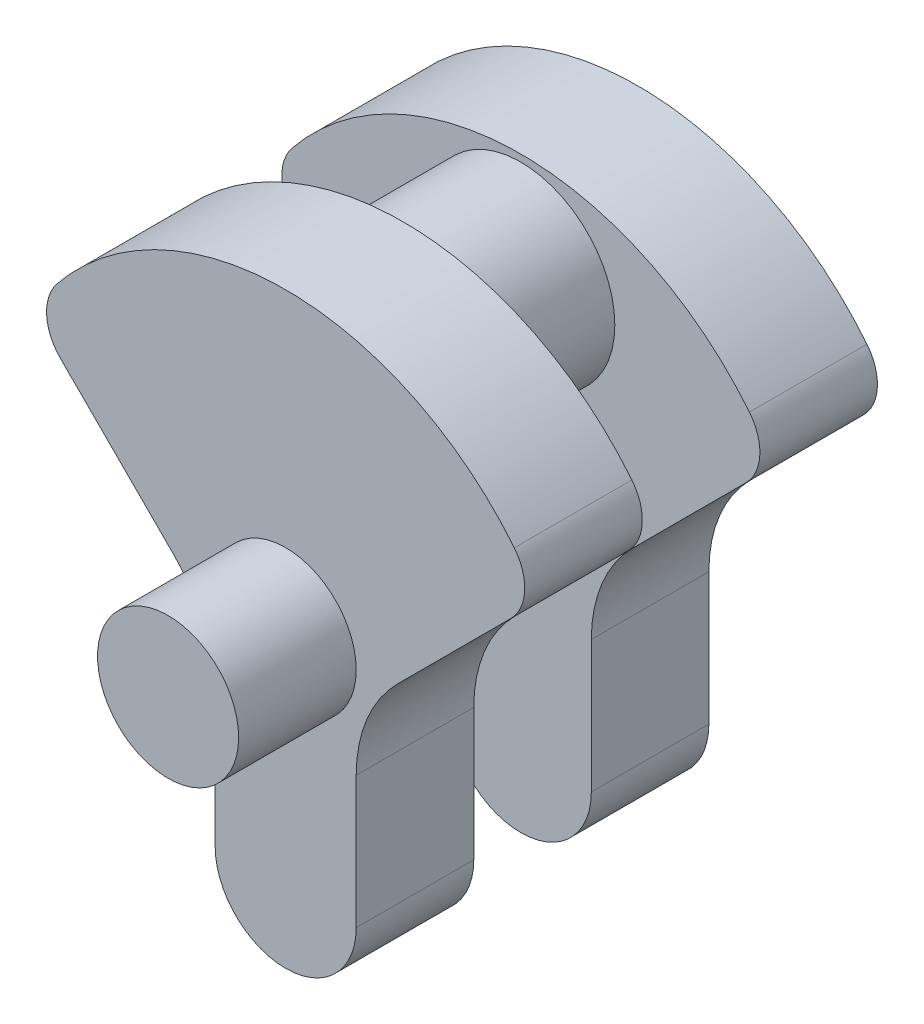
ISO-10303-21;
HEADER;
FILE_DESCRIPTION(('STEP AP214'),'2;1');
FILE_NAME('part.step','',(''),(''),'','','');
FILE_SCHEMA(('AUTOMOTIVE_DESIGN { 1 0 10303 214 1 1 1 1 }'));
ENDSEC;
DATA;
#1=APPLICATION_CONTEXT('core data for automotive mechanical design processes');
#2=APPLICATION_PROTOCOL_DEFINITION('international standard','automotive_design',2000,#1);
#3=PRODUCT_CONTEXT('',#1,'mechanical');
#4=PRODUCT('Part','Part','',(#3));
#5=PRODUCT_RELATED_PRODUCT_CATEGORY('part','',(#4));
#6=PRODUCT_DEFINITION_FORMATION('','',#4);
#7=PRODUCT_DEFINITION_CONTEXT('part definition',#1,'design');
#8=PRODUCT_DEFINITION('design','',#6,#7);
#9=PRODUCT_DEFINITION_SHAPE('','',#8);
#10=(LENGTH_UNIT() NAMED_UNIT(*) SI_UNIT(.MILLI.,.METRE.));
#11=(NAMED_UNIT(*) PLANE_ANGLE_UNIT() SI_UNIT($,.RADIAN.));
#12=(NAMED_UNIT(*) SI_UNIT($,.STERADIAN.) SOLID_ANGLE_UNIT());
#13=UNCERTAINTY_MEASURE_WITH_UNIT(LENGTH_MEASURE(1.E-05),#10,'distance_accuracy_value','');
#14=(GEOMETRIC_REPRESENTATION_CONTEXT(3) GLOBAL_UNCERTAINTY_ASSIGNED_CONTEXT((#13)) GLOBAL_UNIT_ASSIGNED_CONTEXT((#10,
#11,#12)) REPRESENTATION_CONTEXT('',''));
#15=CARTESIAN_POINT('',(0.,0.,0.));
#16=DIRECTION('',(0.,0.,1.));
#17=DIRECTION('',(1.,0.,0.));
#18=AXIS2_PLACEMENT_3D('',#15,#16,#17);
#19=CARTESIAN_POINT('',(11.,-11.,37.5));
#20=DIRECTION('',(-0.707106781186549,0.707106781186546,0.));
#21=DIRECTION('',(-0.707106781186546,-0.707106781186549,0.));
#22=AXIS2_PLACEMENT_3D('',#19,#20,#21);
#23=PLANE('',#22);
#24=DIRECTION('',(0.707106781186546,0.707106781186549,0.));
#25=VECTOR('',#24,1.);
#26=CARTESIAN_POINT('',(11.,-11.,37.5));
#27=LINE('',#26,#25);
#28=CARTESIAN_POINT('',(23.7867965644035,1.78679656440356,37.5));
#29=VERTEX_POINT('',#28);
#30=CARTESIAN_POINT('',(47.9146108182253,25.9146108182255,37.5));
#31=VERTEX_POINT('',#30);
#32=EDGE_CURVE('E269',#29,#31,#27,.T.);
#33=ORIENTED_EDGE('',*,*,#32,.F.);
#34=DIRECTION('',(0.,0.,-1.));
#35=VECTOR('',#34,1.);
#36=CARTESIAN_POINT('',(23.7867965644035,1.78679656440356,37.5));
#37=LINE('',#36,#35);
#38=CARTESIAN_POINT('',(23.7867965644035,1.78679656440356,12.5));
#39=VERTEX_POINT('',#38);
#40=EDGE_CURVE('E211',#29,#39,#37,.T.);
#41=ORIENTED_EDGE('',*,*,#40,.T.);
#42=DIRECTION('',(0.707106781186546,0.707106781186549,0.));
#43=VECTOR('',#42,1.);
#44=CARTESIAN_POINT('',(11.,-11.,12.5));
#45=LINE('',#44,#43);
#46=CARTESIAN_POINT('',(47.9146108182253,25.9146108182255,12.5));
#47=VERTEX_POINT('',#46);
#48=EDGE_CURVE('E326',#39,#47,#45,.T.);
#49=ORIENTED_EDGE('',*,*,#48,.T.);
#50=DIRECTION('',(0.,0.,-1.));
#51=VECTOR('',#50,1.);
#52=CARTESIAN_POINT('',(47.9146108182253,25.9146108182255,37.5));
#53=LINE('',#52,#51);
#54=EDGE_CURVE('E288',#47,#31,#53,.F.);
#55=ORIENTED_EDGE('',*,*,#54,.T.);
#56=EDGE_LOOP('',(#33,#41,#49,#55));
#57=FACE_BOUND('',#56,.T.);
#58=ADVANCED_FACE('F35',(#57),#23,.F.);
#59=CARTESIAN_POINT('',(0.,0.,37.5));
#60=DIRECTION('',(0.,0.,-1.));
#61=DIRECTION('',(-1.,0.,0.));
#62=AXIS2_PLACEMENT_3D('',#59,#60,#61);
#63=CYLINDRICAL_SURFACE('',#62,62.5);
#64=DIRECTION('',(0.,0.,-1.));
#65=VECTOR('',#64,1.);
#66=CARTESIAN_POINT('',(48.6232654837617,39.2686650358225,37.5));
#67=LINE('',#66,#65);
#68=CARTESIAN_POINT('',(48.6232654837617,39.2686650358225,37.5));
#69=VERTEX_POINT('',#68);
#70=CARTESIAN_POINT('',(48.6232654837617,39.2686650358225,12.5));
#71=VERTEX_POINT('',#70);
#72=EDGE_CURVE('E281',#69,#71,#67,.T.);
#73=ORIENTED_EDGE('',*,*,#72,.T.);
#74=CARTESIAN_POINT('',(0.,0.,12.5));
#75=DIRECTION('',(0.,0.,1.));
#76=DIRECTION('',(1.,0.,0.));
#77=AXIS2_PLACEMENT_3D('',#74,#75,#76);
#78=CIRCLE('',#77,62.5);
#79=CARTESIAN_POINT('',(-48.6232654837617,39.2686650358225,12.5));
#80=VERTEX_POINT('',#79);
#81=EDGE_CURVE('E311',#71,#80,#78,.T.);
#82=ORIENTED_EDGE('',*,*,#81,.T.);
#83=DIRECTION('',(0.,0.,-1.));
#84=VECTOR('',#83,1.);
#85=CARTESIAN_POINT('',(-48.6232654837617,39.2686650358225,37.5));
#86=LINE('',#85,#84);
#87=CARTESIAN_POINT('',(-48.6232654837617,39.2686650358225,37.5));
#88=VERTEX_POINT('',#87);
#89=EDGE_CURVE('E277',#80,#88,#86,.F.);
#90=ORIENTED_EDGE('',*,*,#89,.T.);
#91=CARTESIAN_POINT('',(0.,0.,37.5));
#92=DIRECTION('',(0.,0.,1.));
#93=DIRECTION('',(1.,0.,0.));
#94=AXIS2_PLACEMENT_3D('',#91,#92,#93);
#95=CIRCLE('',#94,62.5);
#96=EDGE_CURVE('E299',#69,#88,#95,.T.);
#97=ORIENTED_EDGE('',*,*,#96,.F.);
#98=EDGE_LOOP('',(#73,#82,#90,#97));
#99=FACE_BOUND('',#98,.T.);
#100=ADVANCED_FACE('F315',(#99),#63,.T.);
#101=CARTESIAN_POINT('',(-11.,-11.,37.5));
#102=DIRECTION('',(0.707106781186549,0.707106781186546,0.));
#103=DIRECTION('',(-0.707106781186546,0.707106781186549,0.));
#104=AXIS2_PLACEMENT_3D('',#101,#102,#103);
#105=PLANE('',#104);
#106=DIRECTION('',(0.707106781186546,-0.707106781186549,0.));
#107=VECTOR('',#106,1.);
#108=CARTESIAN_POINT('',(-11.,-11.,12.5));
#109=LINE('',#108,#107);
#110=CARTESIAN_POINT('',(-47.9146108182253,25.9146108182254,12.5));
#111=VERTEX_POINT('',#110);
#112=CARTESIAN_POINT('',(-23.7867965644035,1.78679656440357,12.5));
#113=VERTEX_POINT('',#112);
#114=EDGE_CURVE('E313',#111,#113,#109,.T.);
#115=ORIENTED_EDGE('',*,*,#114,.T.);
#116=DIRECTION('',(0.,0.,-1.));
#117=VECTOR('',#116,1.);
#118=CARTESIAN_POINT('',(-23.7867965644035,1.78679656440357,37.5));
#119=LINE('',#118,#117);
#120=CARTESIAN_POINT('',(-23.7867965644035,1.78679656440357,37.5));
#121=VERTEX_POINT('',#120);
#122=EDGE_CURVE('E50',#113,#121,#119,.F.);
#123=ORIENTED_EDGE('',*,*,#122,.T.);
#124=DIRECTION('',(0.707106781186546,-0.707106781186549,0.));
#125=VECTOR('',#124,1.);
#126=CARTESIAN_POINT('',(-11.,-11.,37.5));
#127=LINE('',#126,#125);
#128=CARTESIAN_POINT('',(-47.9146108182253,25.9146108182254,37.5));
#129=VERTEX_POINT('',#128);
#130=EDGE_CURVE('E296',#129,#121,#127,.T.);
#131=ORIENTED_EDGE('',*,*,#130,.F.);
#132=DIRECTION('',(0.,0.,-1.));
#133=VECTOR('',#132,1.);
#134=CARTESIAN_POINT('',(-47.9146108182253,25.9146108182254,37.5));
#135=LINE('',#134,#133);
#136=EDGE_CURVE('E184',#129,#111,#135,.T.);
#137=ORIENTED_EDGE('',*,*,#136,.T.);
#138=EDGE_LOOP('',(#115,#123,#131,#137));
#139=FACE_BOUND('',#138,.T.);
#140=ADVANCED_FACE('F303',(#139),#105,.F.);
#141=CARTESIAN_POINT('',(-15.,0.,37.5));
#142=DIRECTION('',(1.,0.,0.));
#143=DIRECTION('',(0.,1.,0.));
#144=AXIS2_PLACEMENT_3D('',#141,#142,#143);
#145=PLANE('',#144);
#146=DIRECTION('',(0.,-1.,0.));
#147=VECTOR('',#146,1.);
#148=CARTESIAN_POINT('',(-15.,0.,37.5));
#149=LINE('',#148,#147);
#150=CARTESIAN_POINT('',(-15.,-19.4264068711928,37.5));
#151=VERTEX_POINT('',#150);
#152=CARTESIAN_POINT('',(-15.,-47.5,37.5));
#153=VERTEX_POINT('',#152);
#154=EDGE_CURVE('E304',#151,#153,#149,.T.);
#155=ORIENTED_EDGE('',*,*,#154,.F.);
#156=DIRECTION('',(0.,0.,-1.));
#157=VECTOR('',#156,1.);
#158=CARTESIAN_POINT('',(-15.,-19.4264068711928,12.5));
#159=LINE('',#158,#157);
#160=CARTESIAN_POINT('',(-15.,-19.4264068711928,12.5));
#161=VERTEX_POINT('',#160);
#162=EDGE_CURVE('E220',#151,#161,#159,.T.);
#163=ORIENTED_EDGE('',*,*,#162,.T.);
#164=DIRECTION('',(0.,-1.,0.));
#165=VECTOR('',#164,1.);
#166=CARTESIAN_POINT('',(-15.,0.,12.5));
#167=LINE('',#166,#165);
#168=CARTESIAN_POINT('',(-15.,-47.5,12.5));
#169=VERTEX_POINT('',#168);
#170=EDGE_CURVE('E319',#161,#169,#167,.T.);
#171=ORIENTED_EDGE('',*,*,#170,.T.);
#172=DIRECTION('',(0.,0.,-1.));
#173=VECTOR('',#172,1.);
#174=CARTESIAN_POINT('',(-15.,-47.5,37.5));
#175=LINE('',#174,#173);
#176=EDGE_CURVE('E274',#153,#169,#175,.T.);
#177=ORIENTED_EDGE('',*,*,#176,.F.);
#178=EDGE_LOOP('',(#155,#163,#171,#177));
#179=FACE_BOUND('',#178,.T.);
#180=ADVANCED_FACE('F404',(#179),#145,.F.);
#181=CARTESIAN_POINT('',(0.,-47.5,37.5));
#182=DIRECTION('',(0.,0.,-1.));
#183=DIRECTION('',(-1.,0.,0.));
#184=AXIS2_PLACEMENT_3D('',#181,#182,#183);
#185=CYLINDRICAL_SURFACE('',#184,15.);
#186=ORIENTED_EDGE('',*,*,#176,.T.);
#187=CARTESIAN_POINT('',(0.,-47.5,12.5));
#188=DIRECTION('',(0.,0.,1.));
#189=DIRECTION('',(1.,0.,0.));
#190=AXIS2_PLACEMENT_3D('',#187,#188,#189);
#191=CIRCLE('',#190,15.);
#192=CARTESIAN_POINT('',(15.,-47.5,12.5));
#193=VERTEX_POINT('',#192);
#194=EDGE_CURVE('E330',#169,#193,#191,.T.);
#195=ORIENTED_EDGE('',*,*,#194,.T.);
#196=DIRECTION('',(0.,0.,-1.));
#197=VECTOR('',#196,1.);
#198=CARTESIAN_POINT('',(15.,-47.5,37.5));
#199=LINE('',#198,#197);
#200=CARTESIAN_POINT('',(15.,-47.5,37.5));
#201=VERTEX_POINT('',#200);
#202=EDGE_CURVE('E270',#201,#193,#199,.T.);
#203=ORIENTED_EDGE('',*,*,#202,.F.);
#204=CARTESIAN_POINT('',(0.,-47.5,37.5));
#205=DIRECTION('',(0.,0.,1.));
#206=DIRECTION('',(1.,0.,0.));
#207=AXIS2_PLACEMENT_3D('',#204,#205,#206);
#208=CIRCLE('',#207,15.);
#209=EDGE_CURVE('E336',#153,#201,#208,.T.);
#210=ORIENTED_EDGE('',*,*,#209,.F.);
#211=EDGE_LOOP('',(#186,#195,#203,#210));
#212=FACE_BOUND('',#211,.T.);
#213=ADVANCED_FACE('F409',(#212),#185,.T.);
#214=CARTESIAN_POINT('',(15.,0.,37.5));
#215=DIRECTION('',(1.,0.,0.));
#216=DIRECTION('',(0.,1.,0.));
#217=AXIS2_PLACEMENT_3D('',#214,#215,#216);
#218=PLANE('',#217);
#219=DIRECTION('',(0.,-1.,0.));
#220=VECTOR('',#219,1.);
#221=CARTESIAN_POINT('',(15.,0.,12.5));
#222=LINE('',#221,#220);
#223=CARTESIAN_POINT('',(15.,-19.4264068711928,12.5));
#224=VERTEX_POINT('',#223);
#225=EDGE_CURVE('E328',#224,#193,#222,.T.);
#226=ORIENTED_EDGE('',*,*,#225,.F.);
#227=DIRECTION('',(0.,0.,-1.));
#228=VECTOR('',#227,1.);
#229=CARTESIAN_POINT('',(15.,-19.4264068711928,37.5));
#230=LINE('',#229,#228);
#231=CARTESIAN_POINT('',(15.,-19.4264068711928,37.5));
#232=VERTEX_POINT('',#231);
#233=EDGE_CURVE('E214',#224,#232,#230,.F.);
#234=ORIENTED_EDGE('',*,*,#233,.T.);
#235=DIRECTION('',(0.,-1.,0.));
#236=VECTOR('',#235,1.);
#237=CARTESIAN_POINT('',(15.,0.,37.5));
#238=LINE('',#237,#236);
#239=EDGE_CURVE('E339',#232,#201,#238,.T.);
#240=ORIENTED_EDGE('',*,*,#239,.T.);
#241=ORIENTED_EDGE('',*,*,#202,.T.);
#242=EDGE_LOOP('',(#226,#234,#240,#241));
#243=FACE_BOUND('',#242,.T.);
#244=ADVANCED_FACE('F416',(#243),#218,.T.);
#245=CARTESIAN_POINT('',(0.,0.,37.5));
#246=DIRECTION('',(0.,0.,1.));
#247=DIRECTION('',(1.,0.,0.));
#248=AXIS2_PLACEMENT_3D('',#245,#246,#247);
#249=PLANE('',#248);
#250=CARTESIAN_POINT('',(0.,0.,37.5));
#251=DIRECTION('',(0.,0.,1.));
#252=DIRECTION('',(1.,0.,0.));
#253=AXIS2_PLACEMENT_3D('',#250,#251,#252);
#254=CIRCLE('',#253,15.);
#255=CARTESIAN_POINT('',(15.,0.,37.5));
#256=VERTEX_POINT('',#255);
#257=EDGE_CURVE('E622',#256,#256,#254,.T.);
#258=ORIENTED_EDGE('',*,*,#257,.F.);
#259=EDGE_LOOP('',(#258));
#260=FACE_BOUND('',#259,.T.);
#261=ORIENTED_EDGE('',*,*,#239,.F.);
#262=CARTESIAN_POINT('',(45.,-19.4264068711928,37.5));
#263=DIRECTION('',(0.,0.,1.));
#264=DIRECTION('',(1.,0.,0.));
#265=AXIS2_PLACEMENT_3D('',#262,#263,#264);
#266=CIRCLE('',#265,30.);
#267=EDGE_CURVE('E230',#232,#29,#266,.F.);
#268=ORIENTED_EDGE('',*,*,#267,.T.);
#269=ORIENTED_EDGE('',*,*,#32,.T.);
#270=CARTESIAN_POINT('',(40.8435430063598,32.9856786300909,37.5));
#271=DIRECTION('',(0.,0.,1.));
#272=DIRECTION('',(1.,0.,0.));
#273=AXIS2_PLACEMENT_3D('',#270,#271,#272);
#274=CIRCLE('',#273,10.);
#275=EDGE_CURVE('E198',#31,#69,#274,.T.);
#276=ORIENTED_EDGE('',*,*,#275,.T.);
#277=ORIENTED_EDGE('',*,*,#96,.T.);
#278=CARTESIAN_POINT('',(-40.8435430063598,32.9856786300909,37.5));
#279=DIRECTION('',(0.,0.,1.));
#280=DIRECTION('',(1.,0.,0.));
#281=AXIS2_PLACEMENT_3D('',#278,#279,#280);
#282=CIRCLE('',#281,10.);
#283=EDGE_CURVE('E201',#88,#129,#282,.T.);
#284=ORIENTED_EDGE('',*,*,#283,.T.);
#285=ORIENTED_EDGE('',*,*,#130,.T.);
#286=CARTESIAN_POINT('',(-45.,-19.4264068711928,37.5));
#287=DIRECTION('',(0.,0.,1.));
#288=DIRECTION('',(1.,0.,0.));
#289=AXIS2_PLACEMENT_3D('',#286,#287,#288);
#290=CIRCLE('',#289,30.);
#291=EDGE_CURVE('E11',#121,#151,#290,.F.);
#292=ORIENTED_EDGE('',*,*,#291,.T.);
#293=ORIENTED_EDGE('',*,*,#154,.T.);
#294=ORIENTED_EDGE('',*,*,#209,.T.);
#295=EDGE_LOOP('',(#261,#268,#269,#276,#277,#284,#285,#292,#293,#294));
#296=FACE_BOUND('',#295,.T.);
#297=ADVANCED_FACE('F295',(#260,#296),#249,.T.);
#298=CARTESIAN_POINT('',(40.8435430063598,32.9856786300909,37.5));
#299=DIRECTION('',(0.,0.,-1.));
#300=DIRECTION('',(-1.,0.,0.));
#301=AXIS2_PLACEMENT_3D('',#298,#299,#300);
#302=CYLINDRICAL_SURFACE('',#301,10.);
#303=CARTESIAN_POINT('',(40.8435430063598,32.9856786300909,12.5));
#304=DIRECTION('',(0.,0.,1.));
#305=DIRECTION('',(1.,0.,0.));
#306=AXIS2_PLACEMENT_3D('',#303,#304,#305);
#307=CIRCLE('',#306,10.);
#308=EDGE_CURVE('E317',#71,#47,#307,.F.);
#309=ORIENTED_EDGE('',*,*,#308,.F.);
#310=ORIENTED_EDGE('',*,*,#72,.F.);
#311=ORIENTED_EDGE('',*,*,#275,.F.);
#312=ORIENTED_EDGE('',*,*,#54,.F.);
#313=EDGE_LOOP('',(#309,#310,#311,#312));
#314=FACE_BOUND('',#313,.T.);
#315=ADVANCED_FACE('F389',(#314),#302,.T.);
#316=CARTESIAN_POINT('',(-40.8435430063598,32.9856786300909,37.5));
#317=DIRECTION('',(0.,0.,-1.));
#318=DIRECTION('',(-1.,0.,0.));
#319=AXIS2_PLACEMENT_3D('',#316,#317,#318);
#320=CYLINDRICAL_SURFACE('',#319,10.);
#321=CARTESIAN_POINT('',(-40.8435430063598,32.9856786300909,12.5));
#322=DIRECTION('',(0.,0.,1.));
#323=DIRECTION('',(1.,0.,0.));
#324=AXIS2_PLACEMENT_3D('',#321,#322,#323);
#325=CIRCLE('',#324,10.);
#326=EDGE_CURVE('E183',#111,#80,#325,.F.);
#327=ORIENTED_EDGE('',*,*,#326,.F.);
#328=ORIENTED_EDGE('',*,*,#136,.F.);
#329=ORIENTED_EDGE('',*,*,#283,.F.);
#330=ORIENTED_EDGE('',*,*,#89,.F.);
#331=EDGE_LOOP('',(#327,#328,#329,#330));
#332=FACE_BOUND('',#331,.T.);
#333=ADVANCED_FACE('F307',(#332),#320,.T.);
#334=CARTESIAN_POINT('',(0.,21.,12.5));
#335=DIRECTION('',(0.,0.,1.));
#336=DIRECTION('',(1.,0.,0.));
#337=AXIS2_PLACEMENT_3D('',#334,#335,#336);
#338=PLANE('',#337);
#339=CARTESIAN_POINT('',(0.,41.,12.5));
#340=DIRECTION('',(0.,0.,1.));
#341=DIRECTION('',(1.,0.,0.));
#342=AXIS2_PLACEMENT_3D('',#339,#340,#341);
#343=CIRCLE('',#342,20.);
#344=CARTESIAN_POINT('',(20.,41.,12.5));
#345=VERTEX_POINT('',#344);
#346=EDGE_CURVE('E193',#345,#345,#343,.T.);
#347=ORIENTED_EDGE('',*,*,#346,.T.);
#348=EDGE_LOOP('',(#347));
#349=FACE_BOUND('',#348,.T.);
#350=ORIENTED_EDGE('',*,*,#170,.F.);
#351=CARTESIAN_POINT('',(-45.,-19.4264068711928,12.5));
#352=DIRECTION('',(0.,0.,1.));
#353=DIRECTION('',(1.,0.,0.));
#354=AXIS2_PLACEMENT_3D('',#351,#352,#353);
#355=CIRCLE('',#354,30.);
#356=EDGE_CURVE('E43',#161,#113,#355,.T.);
#357=ORIENTED_EDGE('',*,*,#356,.T.);
#358=ORIENTED_EDGE('',*,*,#114,.F.);
#359=ORIENTED_EDGE('',*,*,#326,.T.);
#360=ORIENTED_EDGE('',*,*,#81,.F.);
#361=ORIENTED_EDGE('',*,*,#308,.T.);
#362=ORIENTED_EDGE('',*,*,#48,.F.);
#363=CARTESIAN_POINT('',(45.,-19.4264068711928,12.5));
#364=DIRECTION('',(0.,0.,1.));
#365=DIRECTION('',(1.,0.,0.));
#366=AXIS2_PLACEMENT_3D('',#363,#364,#365);
#367=CIRCLE('',#366,30.);
#368=EDGE_CURVE('E228',#39,#224,#367,.T.);
#369=ORIENTED_EDGE('',*,*,#368,.T.);
#370=ORIENTED_EDGE('',*,*,#225,.T.);
#371=ORIENTED_EDGE('',*,*,#194,.F.);
#372=EDGE_LOOP('',(#350,#357,#358,#359,#360,#361,#362,#369,#370,#371));
#373=FACE_BOUND('',#372,.T.);
#374=ADVANCED_FACE('F309',(#349,#373),#338,.F.);
#375=CARTESIAN_POINT('',(0.,21.,-12.5));
#376=DIRECTION('',(0.,0.,1.));
#377=DIRECTION('',(1.,0.,0.));
#378=AXIS2_PLACEMENT_3D('',#375,#376,#377);
#379=PLANE('',#378);
#380=CARTESIAN_POINT('',(0.,41.,-12.5));
#381=DIRECTION('',(0.,0.,1.));
#382=DIRECTION('',(1.,0.,0.));
#383=AXIS2_PLACEMENT_3D('',#380,#381,#382);
#384=CIRCLE('',#383,20.);
#385=CARTESIAN_POINT('',(20.,41.,-12.5));
#386=VERTEX_POINT('',#385);
#387=EDGE_CURVE('E632',#386,#386,#384,.T.);
#388=ORIENTED_EDGE('',*,*,#387,.F.);
#389=EDGE_LOOP('',(#388));
#390=FACE_BOUND('',#389,.T.);
#391=CARTESIAN_POINT('',(0.,-47.5,-12.5));
#392=DIRECTION('',(0.,0.,1.));
#393=DIRECTION('',(1.,0.,0.));
#394=AXIS2_PLACEMENT_3D('',#391,#392,#393);
#395=CIRCLE('',#394,15.);
#396=CARTESIAN_POINT('',(-15.,-47.5,-12.5));
#397=VERTEX_POINT('',#396);
#398=CARTESIAN_POINT('',(15.,-47.5,-12.5));
#399=VERTEX_POINT('',#398);
#400=EDGE_CURVE('E321',#397,#399,#395,.T.);
#401=ORIENTED_EDGE('',*,*,#400,.T.);
#402=DIRECTION('',(0.,-1.,0.));
#403=VECTOR('',#402,1.);
#404=CARTESIAN_POINT('',(15.,0.,-12.5));
#405=LINE('',#404,#403);
#406=CARTESIAN_POINT('',(15.,-19.4264068711928,-12.5));
#407=VERTEX_POINT('',#406);
#408=EDGE_CURVE('E355',#407,#399,#405,.T.);
#409=ORIENTED_EDGE('',*,*,#408,.F.);
#410=CARTESIAN_POINT('',(45.,-19.4264068711928,-12.5));
#411=DIRECTION('',(0.,0.,1.));
#412=DIRECTION('',(1.,0.,0.));
#413=AXIS2_PLACEMENT_3D('',#410,#411,#412);
#414=CIRCLE('',#413,30.);
#415=CARTESIAN_POINT('',(23.7867965644035,1.78679656440356,-12.5));
#416=VERTEX_POINT('',#415);
#417=EDGE_CURVE('E226',#407,#416,#414,.F.);
#418=ORIENTED_EDGE('',*,*,#417,.T.);
#419=DIRECTION('',(0.707106781186546,0.707106781186549,0.));
#420=VECTOR('',#419,1.);
#421=CARTESIAN_POINT('',(11.,-11.,-12.5));
#422=LINE('',#421,#420);
#423=CARTESIAN_POINT('',(47.9146108182253,25.9146108182255,-12.5));
#424=VERTEX_POINT('',#423);
#425=EDGE_CURVE('E246',#416,#424,#422,.T.);
#426=ORIENTED_EDGE('',*,*,#425,.T.);
#427=CARTESIAN_POINT('',(40.8435430063598,32.9856786300909,-12.5));
#428=DIRECTION('',(0.,0.,1.));
#429=DIRECTION('',(1.,0.,0.));
#430=AXIS2_PLACEMENT_3D('',#427,#428,#429);
#431=CIRCLE('',#430,10.);
#432=CARTESIAN_POINT('',(48.6232654837617,39.2686650358225,-12.5));
#433=VERTEX_POINT('',#432);
#434=EDGE_CURVE('E247',#433,#424,#431,.F.);
#435=ORIENTED_EDGE('',*,*,#434,.F.);
#436=CARTESIAN_POINT('',(0.,0.,-12.5));
#437=DIRECTION('',(0.,0.,1.));
#438=DIRECTION('',(1.,0.,0.));
#439=AXIS2_PLACEMENT_3D('',#436,#437,#438);
#440=CIRCLE('',#439,62.5);
#441=CARTESIAN_POINT('',(-48.6232654837617,39.2686650358225,-12.5));
#442=VERTEX_POINT('',#441);
#443=EDGE_CURVE('E178',#433,#442,#440,.T.);
#444=ORIENTED_EDGE('',*,*,#443,.T.);
#445=CARTESIAN_POINT('',(-40.8435430063598,32.9856786300909,-12.5));
#446=DIRECTION('',(0.,0.,1.));
#447=DIRECTION('',(1.,0.,0.));
#448=AXIS2_PLACEMENT_3D('',#445,#446,#447);
#449=CIRCLE('',#448,10.);
#450=CARTESIAN_POINT('',(-47.9146108182253,25.9146108182254,-12.5));
#451=VERTEX_POINT('',#450);
#452=EDGE_CURVE('E171',#451,#442,#449,.F.);
#453=ORIENTED_EDGE('',*,*,#452,.F.);
#454=DIRECTION('',(0.707106781186546,-0.707106781186549,0.));
#455=VECTOR('',#454,1.);
#456=CARTESIAN_POINT('',(-11.,-11.,-12.5));
#457=LINE('',#456,#455);
#458=CARTESIAN_POINT('',(-23.7867965644035,1.78679656440357,-12.5));
#459=VERTEX_POINT('',#458);
#460=EDGE_CURVE('E175',#451,#459,#457,.T.);
#461=ORIENTED_EDGE('',*,*,#460,.T.);
#462=CARTESIAN_POINT('',(-45.,-19.4264068711928,-12.5));
#463=DIRECTION('',(0.,0.,1.));
#464=DIRECTION('',(1.,0.,0.));
#465=AXIS2_PLACEMENT_3D('',#462,#463,#464);
#466=CIRCLE('',#465,30.);
#467=CARTESIAN_POINT('',(-15.,-19.4264068711928,-12.5));
#468=VERTEX_POINT('',#467);
#469=EDGE_CURVE('E234',#459,#468,#466,.F.);
#470=ORIENTED_EDGE('',*,*,#469,.T.);
#471=DIRECTION('',(0.,-1.,0.));
#472=VECTOR('',#471,1.);
#473=CARTESIAN_POINT('',(-15.,0.,-12.5));
#474=LINE('',#473,#472);
#475=EDGE_CURVE('E236',#468,#397,#474,.T.);
#476=ORIENTED_EDGE('',*,*,#475,.T.);
#477=EDGE_LOOP('',(#401,#409,#418,#426,#435,#444,#453,#461,#470,#476));
#478=FACE_BOUND('',#477,.T.);
#479=ADVANCED_FACE('F174',(#390,#478),#379,.T.);
#480=CARTESIAN_POINT('',(0.,41.,37.5));
#481=DIRECTION('',(0.,0.,1.));
#482=DIRECTION('',(1.,0.,0.));
#483=AXIS2_PLACEMENT_3D('',#480,#481,#482);
#484=CYLINDRICAL_SURFACE('',#483,20.);
#485=ORIENTED_EDGE('',*,*,#346,.F.);
#486=EDGE_LOOP('',(#485));
#487=FACE_BOUND('',#486,.T.);
#488=ORIENTED_EDGE('',*,*,#387,.T.);
#489=EDGE_LOOP('',(#488));
#490=FACE_BOUND('',#489,.T.);
#491=ADVANCED_FACE('F483',(#487,#490),#484,.T.);
#492=CARTESIAN_POINT('',(0.,0.,-37.5));
#493=DIRECTION('',(0.,0.,1.));
#494=DIRECTION('',(1.,0.,0.));
#495=AXIS2_PLACEMENT_3D('',#492,#493,#494);
#496=PLANE('',#495);
#497=CARTESIAN_POINT('',(0.,0.,-37.5));
#498=DIRECTION('',(0.,0.,1.));
#499=DIRECTION('',(1.,0.,0.));
#500=AXIS2_PLACEMENT_3D('',#497,#498,#499);
#501=CIRCLE('',#500,15.);
#502=CARTESIAN_POINT('',(15.,0.,-37.5));
#503=VERTEX_POINT('',#502);
#504=EDGE_CURVE('E623',#503,#503,#501,.T.);
#505=ORIENTED_EDGE('',*,*,#504,.T.);
#506=EDGE_LOOP('',(#505));
#507=FACE_BOUND('',#506,.T.);
#508=CARTESIAN_POINT('',(0.,0.,-37.5));
#509=DIRECTION('',(0.,0.,1.));
#510=DIRECTION('',(1.,0.,0.));
#511=AXIS2_PLACEMENT_3D('',#508,#509,#510);
#512=CIRCLE('',#511,62.5);
#513=CARTESIAN_POINT('',(48.6232654837617,39.2686650358225,-37.5));
#514=VERTEX_POINT('',#513);
#515=CARTESIAN_POINT('',(-48.6232654837617,39.2686650358225,-37.5));
#516=VERTEX_POINT('',#515);
#517=EDGE_CURVE('E256',#514,#516,#512,.T.);
#518=ORIENTED_EDGE('',*,*,#517,.F.);
#519=CARTESIAN_POINT('',(40.8435430063598,32.9856786300909,-37.5));
#520=DIRECTION('',(0.,0.,1.));
#521=DIRECTION('',(1.,0.,0.));
#522=AXIS2_PLACEMENT_3D('',#519,#520,#521);
#523=CIRCLE('',#522,10.);
#524=CARTESIAN_POINT('',(47.9146108182253,25.9146108182255,-37.5));
#525=VERTEX_POINT('',#524);
#526=EDGE_CURVE('E285',#514,#525,#523,.F.);
#527=ORIENTED_EDGE('',*,*,#526,.T.);
#528=DIRECTION('',(0.707106781186546,0.707106781186549,0.));
#529=VECTOR('',#528,1.);
#530=CARTESIAN_POINT('',(11.,-11.,-37.5));
#531=LINE('',#530,#529);
#532=CARTESIAN_POINT('',(23.7867965644035,1.78679656440356,-37.5));
#533=VERTEX_POINT('',#532);
#534=EDGE_CURVE('E261',#533,#525,#531,.T.);
#535=ORIENTED_EDGE('',*,*,#534,.F.);
#536=CARTESIAN_POINT('',(45.,-19.4264068711928,-37.5));
#537=DIRECTION('',(0.,0.,1.));
#538=DIRECTION('',(1.,0.,0.));
#539=AXIS2_PLACEMENT_3D('',#536,#537,#538);
#540=CIRCLE('',#539,30.);
#541=CARTESIAN_POINT('',(15.,-19.4264068711928,-37.5));
#542=VERTEX_POINT('',#541);
#543=EDGE_CURVE('E224',#533,#542,#540,.T.);
#544=ORIENTED_EDGE('',*,*,#543,.T.);
#545=DIRECTION('',(0.,-1.,0.));
#546=VECTOR('',#545,1.);
#547=CARTESIAN_POINT('',(15.,0.,-37.5));
#548=LINE('',#547,#546);
#549=CARTESIAN_POINT('',(15.,-47.5,-37.5));
#550=VERTEX_POINT('',#549);
#551=EDGE_CURVE('E267',#542,#550,#548,.T.);
#552=ORIENTED_EDGE('',*,*,#551,.T.);
#553=CARTESIAN_POINT('',(0.,-47.5,-37.5));
#554=DIRECTION('',(0.,0.,1.));
#555=DIRECTION('',(1.,0.,0.));
#556=AXIS2_PLACEMENT_3D('',#553,#554,#555);
#557=CIRCLE('',#556,15.);
#558=CARTESIAN_POINT('',(-15.,-47.5,-37.5));
#559=VERTEX_POINT('',#558);
#560=EDGE_CURVE('E258',#559,#550,#557,.T.);
#561=ORIENTED_EDGE('',*,*,#560,.F.);
#562=DIRECTION('',(0.,-1.,0.));
#563=VECTOR('',#562,1.);
#564=CARTESIAN_POINT('',(-15.,0.,-37.5));
#565=LINE('',#564,#563);
#566=CARTESIAN_POINT('',(-15.,-19.4264068711928,-37.5));
#567=VERTEX_POINT('',#566);
#568=EDGE_CURVE('E255',#567,#559,#565,.T.);
#569=ORIENTED_EDGE('',*,*,#568,.F.);
#570=CARTESIAN_POINT('',(-45.,-19.4264068711928,-37.5));
#571=DIRECTION('',(0.,0.,1.));
#572=DIRECTION('',(1.,0.,0.));
#573=AXIS2_PLACEMENT_3D('',#570,#571,#572);
#574=CIRCLE('',#573,30.);
#575=CARTESIAN_POINT('',(-23.7867965644035,1.78679656440357,-37.5));
#576=VERTEX_POINT('',#575);
#577=EDGE_CURVE('E232',#567,#576,#574,.T.);
#578=ORIENTED_EDGE('',*,*,#577,.T.);
#579=DIRECTION('',(0.707106781186546,-0.707106781186549,0.));
#580=VECTOR('',#579,1.);
#581=CARTESIAN_POINT('',(-11.,-11.,-37.5));
#582=LINE('',#581,#580);
#583=CARTESIAN_POINT('',(-47.9146108182253,25.9146108182254,-37.5));
#584=VERTEX_POINT('',#583);
#585=EDGE_CURVE('E253',#584,#576,#582,.T.);
#586=ORIENTED_EDGE('',*,*,#585,.F.);
#587=CARTESIAN_POINT('',(-40.8435430063598,32.9856786300909,-37.5));
#588=DIRECTION('',(0.,0.,1.));
#589=DIRECTION('',(1.,0.,0.));
#590=AXIS2_PLACEMENT_3D('',#587,#588,#589);
#591=CIRCLE('',#590,10.);
#592=EDGE_CURVE('E196',#584,#516,#591,.F.);
#593=ORIENTED_EDGE('',*,*,#592,.T.);
#594=EDGE_LOOP('',(#518,#527,#535,#544,#552,#561,#569,#578,#586,#593));
#595=FACE_BOUND('',#594,.T.);
#596=ADVANCED_FACE('F252',(#507,#595),#496,.F.);
#597=ORIENTED_EDGE('',*,*,#551,.F.);
#598=DIRECTION('',(0.,0.,-1.));
#599=VECTOR('',#598,1.);
#600=CARTESIAN_POINT('',(15.,-19.4264068711928,37.5));
#601=LINE('',#600,#599);
#602=EDGE_CURVE('E209',#542,#407,#601,.F.);
#603=ORIENTED_EDGE('',*,*,#602,.T.);
#604=ORIENTED_EDGE('',*,*,#408,.T.);
#605=EDGE_CURVE('E273',#399,#550,#199,.T.);
#606=ORIENTED_EDGE('',*,*,#605,.T.);
#607=EDGE_LOOP('',(#597,#603,#604,#606));
#608=FACE_BOUND('',#607,.T.);
#609=ADVANCED_FACE('F364',(#608),#218,.T.);
#610=ORIENTED_EDGE('',*,*,#400,.F.);
#611=EDGE_CURVE('E245',#397,#559,#175,.T.);
#612=ORIENTED_EDGE('',*,*,#611,.T.);
#613=ORIENTED_EDGE('',*,*,#560,.T.);
#614=ORIENTED_EDGE('',*,*,#605,.F.);
#615=EDGE_LOOP('',(#610,#612,#613,#614));
#616=FACE_BOUND('',#615,.T.);
#617=ADVANCED_FACE('F361',(#616),#185,.T.);
#618=ORIENTED_EDGE('',*,*,#475,.F.);
#619=DIRECTION('',(0.,0.,-1.));
#620=VECTOR('',#619,1.);
#621=CARTESIAN_POINT('',(-15.,-19.4264068711928,-37.5));
#622=LINE('',#621,#620);
#623=EDGE_CURVE('E216',#468,#567,#622,.T.);
#624=ORIENTED_EDGE('',*,*,#623,.T.);
#625=ORIENTED_EDGE('',*,*,#568,.T.);
#626=ORIENTED_EDGE('',*,*,#611,.F.);
#627=EDGE_LOOP('',(#618,#624,#625,#626));
#628=FACE_BOUND('',#627,.T.);
#629=ADVANCED_FACE('F242',(#628),#145,.F.);
#630=EDGE_CURVE('E189',#451,#584,#135,.T.);
#631=ORIENTED_EDGE('',*,*,#630,.F.);
#632=ORIENTED_EDGE('',*,*,#452,.T.);
#633=EDGE_CURVE('E278',#516,#442,#86,.F.);
#634=ORIENTED_EDGE('',*,*,#633,.F.);
#635=ORIENTED_EDGE('',*,*,#592,.F.);
#636=EDGE_LOOP('',(#631,#632,#634,#635));
#637=FACE_BOUND('',#636,.T.);
#638=ADVANCED_FACE('F195',(#637),#320,.T.);
#639=ORIENTED_EDGE('',*,*,#585,.T.);
#640=DIRECTION('',(0.,0.,-1.));
#641=VECTOR('',#640,1.);
#642=CARTESIAN_POINT('',(-23.7867965644035,1.78679656440357,-12.5));
#643=LINE('',#642,#641);
#644=EDGE_CURVE('E192',#576,#459,#643,.F.);
#645=ORIENTED_EDGE('',*,*,#644,.T.);
#646=ORIENTED_EDGE('',*,*,#460,.F.);
#647=ORIENTED_EDGE('',*,*,#630,.T.);
#648=EDGE_LOOP('',(#639,#645,#646,#647));
#649=FACE_BOUND('',#648,.T.);
#650=ADVANCED_FACE('F188',(#649),#105,.F.);
#651=EDGE_CURVE('E280',#433,#514,#67,.T.);
#652=ORIENTED_EDGE('',*,*,#651,.F.);
#653=ORIENTED_EDGE('',*,*,#434,.T.);
#654=EDGE_CURVE('E289',#525,#424,#53,.F.);
#655=ORIENTED_EDGE('',*,*,#654,.F.);
#656=ORIENTED_EDGE('',*,*,#526,.F.);
#657=EDGE_LOOP('',(#652,#653,#655,#656));
#658=FACE_BOUND('',#657,.T.);
#659=ADVANCED_FACE('F350',(#658),#302,.T.);
#660=ORIENTED_EDGE('',*,*,#443,.F.);
#661=ORIENTED_EDGE('',*,*,#651,.T.);
#662=ORIENTED_EDGE('',*,*,#517,.T.);
#663=ORIENTED_EDGE('',*,*,#633,.T.);
#664=EDGE_LOOP('',(#660,#661,#662,#663));
#665=FACE_BOUND('',#664,.T.);
#666=ADVANCED_FACE('F377',(#665),#63,.T.);
#667=ORIENTED_EDGE('',*,*,#425,.F.);
#668=DIRECTION('',(0.,0.,-1.));
#669=VECTOR('',#668,1.);
#670=CARTESIAN_POINT('',(23.7867965644035,1.78679656440356,37.5));
#671=LINE('',#670,#669);
#672=EDGE_CURVE('E206',#416,#533,#671,.T.);
#673=ORIENTED_EDGE('',*,*,#672,.T.);
#674=ORIENTED_EDGE('',*,*,#534,.T.);
#675=ORIENTED_EDGE('',*,*,#654,.T.);
#676=EDGE_LOOP('',(#667,#673,#674,#675));
#677=FACE_BOUND('',#676,.T.);
#678=ADVANCED_FACE('F343',(#677),#23,.F.);
#679=CARTESIAN_POINT('',(45.,-19.4264068711928,37.5));
#680=DIRECTION('',(0.,0.,-1.));
#681=DIRECTION('',(-1.,0.,0.));
#682=AXIS2_PLACEMENT_3D('',#679,#680,#681);
#683=CYLINDRICAL_SURFACE('',#682,30.);
#684=ORIENTED_EDGE('',*,*,#417,.F.);
#685=ORIENTED_EDGE('',*,*,#602,.F.);
#686=ORIENTED_EDGE('',*,*,#543,.F.);
#687=ORIENTED_EDGE('',*,*,#672,.F.);
#688=EDGE_LOOP('',(#684,#685,#686,#687));
#689=FACE_BOUND('',#688,.T.);
#690=ADVANCED_FACE('F367',(#689),#683,.F.);
#691=CARTESIAN_POINT('',(45.,-19.4264068711928,37.5));
#692=DIRECTION('',(0.,0.,-1.));
#693=DIRECTION('',(-1.,0.,0.));
#694=AXIS2_PLACEMENT_3D('',#691,#692,#693);
#695=CYLINDRICAL_SURFACE('',#694,30.);
#696=ORIENTED_EDGE('',*,*,#267,.F.);
#697=ORIENTED_EDGE('',*,*,#233,.F.);
#698=ORIENTED_EDGE('',*,*,#368,.F.);
#699=ORIENTED_EDGE('',*,*,#40,.F.);
#700=EDGE_LOOP('',(#696,#697,#698,#699));
#701=FACE_BOUND('',#700,.T.);
#702=ADVANCED_FACE('F369',(#701),#695,.F.);
#703=CARTESIAN_POINT('',(-45.,-19.4264068711928,37.5));
#704=DIRECTION('',(0.,0.,1.));
#705=DIRECTION('',(1.,0.,0.));
#706=AXIS2_PLACEMENT_3D('',#703,#704,#705);
#707=CYLINDRICAL_SURFACE('',#706,30.);
#708=ORIENTED_EDGE('',*,*,#469,.F.);
#709=ORIENTED_EDGE('',*,*,#644,.F.);
#710=ORIENTED_EDGE('',*,*,#577,.F.);
#711=ORIENTED_EDGE('',*,*,#623,.F.);
#712=EDGE_LOOP('',(#708,#709,#710,#711));
#713=FACE_BOUND('',#712,.T.);
#714=ADVANCED_FACE('F249',(#713),#707,.F.);
#715=CARTESIAN_POINT('',(-45.,-19.4264068711928,37.5));
#716=DIRECTION('',(0.,0.,1.));
#717=DIRECTION('',(1.,0.,0.));
#718=AXIS2_PLACEMENT_3D('',#715,#716,#717);
#719=CYLINDRICAL_SURFACE('',#718,30.);
#720=ORIENTED_EDGE('',*,*,#291,.F.);
#721=ORIENTED_EDGE('',*,*,#122,.F.);
#722=ORIENTED_EDGE('',*,*,#356,.F.);
#723=ORIENTED_EDGE('',*,*,#162,.F.);
#724=EDGE_LOOP('',(#720,#721,#722,#723));
#725=FACE_BOUND('',#724,.T.);
#726=ADVANCED_FACE('F37',(#725),#719,.F.);
#727=CARTESIAN_POINT('',(0.,0.,62.5));
#728=DIRECTION('',(0.,0.,-1.));
#729=DIRECTION('',(-1.,0.,0.));
#730=AXIS2_PLACEMENT_3D('',#727,#728,#729);
#731=CYLINDRICAL_SURFACE('',#730,15.);
#732=CARTESIAN_POINT('',(0.,0.,62.5));
#733=DIRECTION('',(0.,0.,1.));
#734=DIRECTION('',(1.,0.,0.));
#735=AXIS2_PLACEMENT_3D('',#732,#733,#734);
#736=CIRCLE('',#735,15.);
#737=CARTESIAN_POINT('',(15.,0.,62.5));
#738=VERTEX_POINT('',#737);
#739=EDGE_CURVE('E626',#738,#738,#736,.T.);
#740=ORIENTED_EDGE('',*,*,#739,.F.);
#741=EDGE_LOOP('',(#740));
#742=FACE_BOUND('',#741,.T.);
#743=ORIENTED_EDGE('',*,*,#257,.T.);
#744=EDGE_LOOP('',(#743));
#745=FACE_BOUND('',#744,.T.);
#746=ADVANCED_FACE('F424',(#742,#745),#731,.T.);
#747=CARTESIAN_POINT('',(0.,0.,62.5));
#748=DIRECTION('',(0.,0.,1.));
#749=DIRECTION('',(1.,0.,0.));
#750=AXIS2_PLACEMENT_3D('',#747,#748,#749);
#751=PLANE('',#750);
#752=ORIENTED_EDGE('',*,*,#739,.T.);
#753=EDGE_LOOP('',(#752));
#754=FACE_BOUND('',#753,.T.);
#755=ADVANCED_FACE('F429',(#754),#751,.T.);
#756=CARTESIAN_POINT('',(0.,0.,-62.5));
#757=DIRECTION('',(0.,0.,1.));
#758=DIRECTION('',(1.,0.,0.));
#759=AXIS2_PLACEMENT_3D('',#756,#757,#758);
#760=CYLINDRICAL_SURFACE('',#759,15.);
#761=CARTESIAN_POINT('',(0.,0.,-62.5));
#762=DIRECTION('',(0.,0.,1.));
#763=DIRECTION('',(1.,0.,0.));
#764=AXIS2_PLACEMENT_3D('',#761,#762,#763);
#765=CIRCLE('',#764,15.);
#766=CARTESIAN_POINT('',(15.,0.,-62.5));
#767=VERTEX_POINT('',#766);
#768=EDGE_CURVE('E621',#767,#767,#765,.T.);
#769=ORIENTED_EDGE('',*,*,#768,.T.);
#770=EDGE_LOOP('',(#769));
#771=FACE_BOUND('',#770,.T.);
#772=ORIENTED_EDGE('',*,*,#504,.F.);
#773=EDGE_LOOP('',(#772));
#774=FACE_BOUND('',#773,.T.);
#775=ADVANCED_FACE('F588',(#771,#774),#760,.T.);
#776=CARTESIAN_POINT('',(0.,0.,-62.5));
#777=DIRECTION('',(0.,0.,-1.));
#778=DIRECTION('',(1.,0.,0.));
#779=AXIS2_PLACEMENT_3D('',#776,#777,#778);
#780=PLANE('',#779);
#781=ORIENTED_EDGE('',*,*,#768,.F.);
#782=EDGE_LOOP('',(#781));
#783=FACE_BOUND('',#782,.T.);
#784=ADVANCED_FACE('F605',(#783),#780,.T.);
#785=CLOSED_SHELL('',(#58,#100,#140,#180,#213,#244,#297,#315,#333,#374,#479,#491,#596,#609,#617,
#629,#638,#650,#659,#666,#678,#690,#702,#714,#726,#746,#755,#775,#784));
#786=MANIFOLD_SOLID_BREP('B2',#785);
#787=ADVANCED_BREP_SHAPE_REPRESENTATION('',(#18,#786),#14);
#788=SHAPE_DEFINITION_REPRESENTATION(#9,#787);
ENDSEC;
END-ISO-10303-21;
